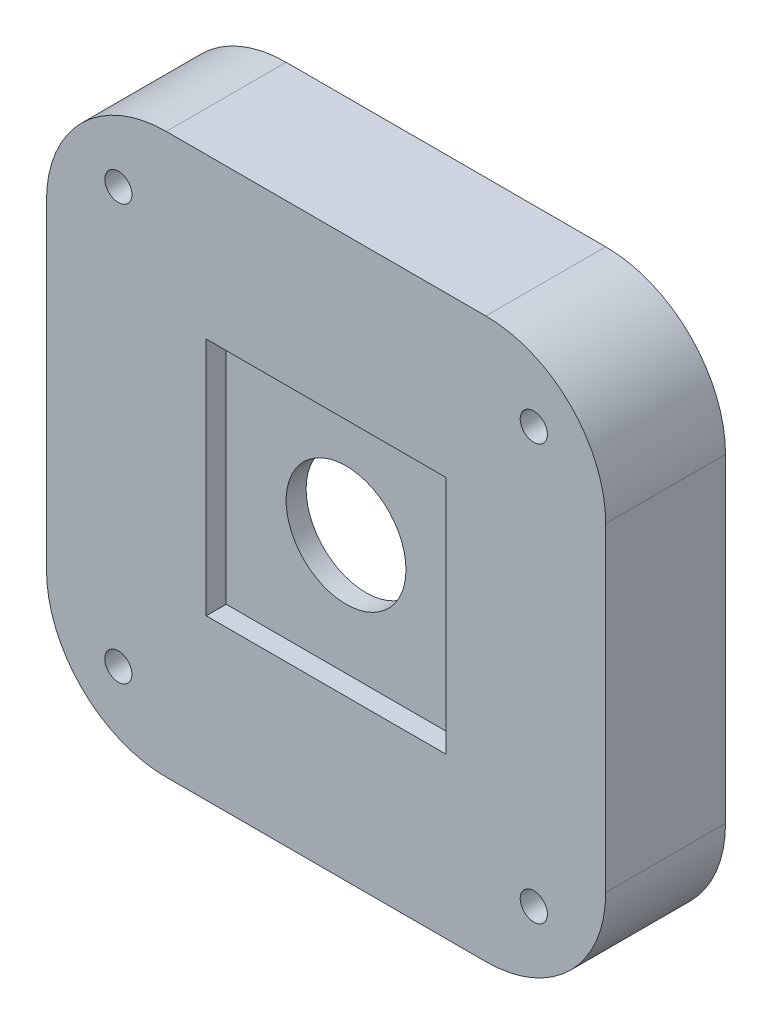
ISO-10303-21;
HEADER;
FILE_DESCRIPTION(('STEP AP214'),'2;1');
FILE_NAME('part.step','',(''),(''),'','','');
FILE_SCHEMA(('AUTOMOTIVE_DESIGN { 1 0 10303 214 1 1 1 1 }'));
ENDSEC;
DATA;
#1=APPLICATION_CONTEXT('core data for automotive mechanical design processes');
#2=APPLICATION_PROTOCOL_DEFINITION('international standard','automotive_design',2000,#1);
#3=PRODUCT_CONTEXT('',#1,'mechanical');
#4=PRODUCT('Part','Part','',(#3));
#5=PRODUCT_RELATED_PRODUCT_CATEGORY('part','',(#4));
#6=PRODUCT_DEFINITION_FORMATION('','',#4);
#7=PRODUCT_DEFINITION_CONTEXT('part definition',#1,'design');
#8=PRODUCT_DEFINITION('design','',#6,#7);
#9=PRODUCT_DEFINITION_SHAPE('','',#8);
#10=(LENGTH_UNIT() NAMED_UNIT(*) SI_UNIT(.MILLI.,.METRE.));
#11=(NAMED_UNIT(*) PLANE_ANGLE_UNIT() SI_UNIT($,.RADIAN.));
#12=(NAMED_UNIT(*) SI_UNIT($,.STERADIAN.) SOLID_ANGLE_UNIT());
#13=UNCERTAINTY_MEASURE_WITH_UNIT(LENGTH_MEASURE(1.E-05),#10,'distance_accuracy_value','');
#14=(GEOMETRIC_REPRESENTATION_CONTEXT(3) GLOBAL_UNCERTAINTY_ASSIGNED_CONTEXT((#13)) GLOBAL_UNIT_ASSIGNED_CONTEXT((#10,
#11,#12)) REPRESENTATION_CONTEXT('',''));
#15=CARTESIAN_POINT('',(0.,0.,0.));
#16=DIRECTION('',(0.,0.,1.));
#17=DIRECTION('',(1.,0.,0.));
#18=AXIS2_PLACEMENT_3D('',#15,#16,#17);
#19=CARTESIAN_POINT('',(0.,0.,0.));
#20=DIRECTION('',(0.,0.,1.));
#21=DIRECTION('',(1.,0.,0.));
#22=AXIS2_PLACEMENT_3D('',#19,#20,#21);
#23=CYLINDRICAL_SURFACE('',#22,7.5);
#24=CARTESIAN_POINT('',(0.,0.,12.5));
#25=DIRECTION('',(0.,0.,1.));
#26=DIRECTION('',(1.,0.,0.));
#27=AXIS2_PLACEMENT_3D('',#24,#25,#26);
#28=CIRCLE('',#27,7.5);
#29=CARTESIAN_POINT('',(7.5,0.,12.5));
#30=VERTEX_POINT('',#29);
#31=EDGE_CURVE('E243',#30,#30,#28,.F.);
#32=ORIENTED_EDGE('',*,*,#31,.F.);
#33=EDGE_LOOP('',(#32));
#34=FACE_BOUND('',#33,.T.);
#35=CARTESIAN_POINT('',(0.,0.,10.));
#36=DIRECTION('',(0.,0.,-1.));
#37=DIRECTION('',(-1.,0.,0.));
#38=AXIS2_PLACEMENT_3D('',#35,#36,#37);
#39=CIRCLE('',#38,7.5);
#40=CARTESIAN_POINT('',(-7.5,0.,10.));
#41=VERTEX_POINT('',#40);
#42=EDGE_CURVE('E47',#41,#41,#39,.F.);
#43=ORIENTED_EDGE('',*,*,#42,.F.);
#44=EDGE_LOOP('',(#43));
#45=FACE_BOUND('',#44,.T.);
#46=ADVANCED_FACE('F43',(#34,#45),#23,.F.);
#47=CARTESIAN_POINT('',(-35.,35.,15.));
#48=DIRECTION('',(1.,0.,0.));
#49=DIRECTION('',(0.,0.,-1.));
#50=AXIS2_PLACEMENT_3D('',#47,#48,#49);
#51=PLANE('',#50);
#52=DIRECTION('',(0.,-1.,0.));
#53=VECTOR('',#52,1.);
#54=CARTESIAN_POINT('',(-35.,35.,0.));
#55=LINE('',#54,#53);
#56=CARTESIAN_POINT('',(-35.,20.,0.));
#57=VERTEX_POINT('',#56);
#58=CARTESIAN_POINT('',(-35.,-20.,0.));
#59=VERTEX_POINT('',#58);
#60=EDGE_CURVE('E284',#57,#59,#55,.T.);
#61=ORIENTED_EDGE('',*,*,#60,.T.);
#62=DIRECTION('',(0.,0.,-1.));
#63=VECTOR('',#62,1.);
#64=CARTESIAN_POINT('',(-35.,-20.,15.));
#65=LINE('',#64,#63);
#66=CARTESIAN_POINT('',(-35.,-20.,15.));
#67=VERTEX_POINT('',#66);
#68=EDGE_CURVE('E358',#59,#67,#65,.F.);
#69=ORIENTED_EDGE('',*,*,#68,.T.);
#70=DIRECTION('',(0.,-1.,0.));
#71=VECTOR('',#70,1.);
#72=CARTESIAN_POINT('',(-35.,35.,15.));
#73=LINE('',#72,#71);
#74=CARTESIAN_POINT('',(-35.,20.,15.));
#75=VERTEX_POINT('',#74);
#76=EDGE_CURVE('E285',#75,#67,#73,.T.);
#77=ORIENTED_EDGE('',*,*,#76,.F.);
#78=DIRECTION('',(0.,0.,-1.));
#79=VECTOR('',#78,1.);
#80=CARTESIAN_POINT('',(-35.,20.,15.));
#81=LINE('',#80,#79);
#82=EDGE_CURVE('E354',#75,#57,#81,.T.);
#83=ORIENTED_EDGE('',*,*,#82,.T.);
#84=EDGE_LOOP('',(#61,#69,#77,#83));
#85=FACE_BOUND('',#84,.T.);
#86=ADVANCED_FACE('F371',(#85),#51,.F.);
#87=CARTESIAN_POINT('',(35.,-35.,15.));
#88=DIRECTION('',(0.,1.,0.));
#89=DIRECTION('',(-1.,0.,0.));
#90=AXIS2_PLACEMENT_3D('',#87,#88,#89);
#91=PLANE('',#90);
#92=DIRECTION('',(1.,0.,0.));
#93=VECTOR('',#92,1.);
#94=CARTESIAN_POINT('',(35.,-35.,0.));
#95=LINE('',#94,#93);
#96=CARTESIAN_POINT('',(-20.,-35.,0.));
#97=VERTEX_POINT('',#96);
#98=CARTESIAN_POINT('',(20.,-35.,0.));
#99=VERTEX_POINT('',#98);
#100=EDGE_CURVE('E306',#97,#99,#95,.T.);
#101=ORIENTED_EDGE('',*,*,#100,.T.);
#102=DIRECTION('',(0.,0.,-1.));
#103=VECTOR('',#102,1.);
#104=CARTESIAN_POINT('',(20.,-35.,15.));
#105=LINE('',#104,#103);
#106=CARTESIAN_POINT('',(20.,-35.,15.));
#107=VERTEX_POINT('',#106);
#108=EDGE_CURVE('E339',#99,#107,#105,.F.);
#109=ORIENTED_EDGE('',*,*,#108,.T.);
#110=DIRECTION('',(1.,0.,0.));
#111=VECTOR('',#110,1.);
#112=CARTESIAN_POINT('',(35.,-35.,15.));
#113=LINE('',#112,#111);
#114=CARTESIAN_POINT('',(-20.,-35.,15.));
#115=VERTEX_POINT('',#114);
#116=EDGE_CURVE('E289',#115,#107,#113,.T.);
#117=ORIENTED_EDGE('',*,*,#116,.F.);
#118=DIRECTION('',(0.,0.,-1.));
#119=VECTOR('',#118,1.);
#120=CARTESIAN_POINT('',(-20.,-35.,15.));
#121=LINE('',#120,#119);
#122=EDGE_CURVE('E335',#115,#97,#121,.T.);
#123=ORIENTED_EDGE('',*,*,#122,.T.);
#124=EDGE_LOOP('',(#101,#109,#117,#123));
#125=FACE_BOUND('',#124,.T.);
#126=ADVANCED_FACE('F443',(#125),#91,.F.);
#127=CARTESIAN_POINT('',(35.,35.,15.));
#128=DIRECTION('',(-1.,0.,0.));
#129=DIRECTION('',(0.,0.,1.));
#130=AXIS2_PLACEMENT_3D('',#127,#128,#129);
#131=PLANE('',#130);
#132=DIRECTION('',(0.,1.,0.));
#133=VECTOR('',#132,1.);
#134=CARTESIAN_POINT('',(35.,35.,15.));
#135=LINE('',#134,#133);
#136=CARTESIAN_POINT('',(35.,-20.,15.));
#137=VERTEX_POINT('',#136);
#138=CARTESIAN_POINT('',(35.,20.,15.));
#139=VERTEX_POINT('',#138);
#140=EDGE_CURVE('E294',#137,#139,#135,.T.);
#141=ORIENTED_EDGE('',*,*,#140,.F.);
#142=DIRECTION('',(0.,0.,-1.));
#143=VECTOR('',#142,1.);
#144=CARTESIAN_POINT('',(35.,-20.,15.));
#145=LINE('',#144,#143);
#146=CARTESIAN_POINT('',(35.,-20.,0.));
#147=VERTEX_POINT('',#146);
#148=EDGE_CURVE('E319',#137,#147,#145,.T.);
#149=ORIENTED_EDGE('',*,*,#148,.T.);
#150=DIRECTION('',(0.,1.,0.));
#151=VECTOR('',#150,1.);
#152=CARTESIAN_POINT('',(35.,35.,0.));
#153=LINE('',#152,#151);
#154=CARTESIAN_POINT('',(35.,20.,0.));
#155=VERTEX_POINT('',#154);
#156=EDGE_CURVE('E310',#147,#155,#153,.T.);
#157=ORIENTED_EDGE('',*,*,#156,.T.);
#158=DIRECTION('',(0.,0.,-1.));
#159=VECTOR('',#158,1.);
#160=CARTESIAN_POINT('',(35.,20.,15.));
#161=LINE('',#160,#159);
#162=EDGE_CURVE('E302',#155,#139,#161,.F.);
#163=ORIENTED_EDGE('',*,*,#162,.T.);
#164=EDGE_LOOP('',(#141,#149,#157,#163));
#165=FACE_BOUND('',#164,.T.);
#166=ADVANCED_FACE('F439',(#165),#131,.F.);
#167=CARTESIAN_POINT('',(35.,35.,15.));
#168=DIRECTION('',(0.,-1.,0.));
#169=DIRECTION('',(0.,0.,-1.));
#170=AXIS2_PLACEMENT_3D('',#167,#168,#169);
#171=PLANE('',#170);
#172=DIRECTION('',(-1.,0.,0.));
#173=VECTOR('',#172,1.);
#174=CARTESIAN_POINT('',(35.,35.,0.));
#175=LINE('',#174,#173);
#176=CARTESIAN_POINT('',(20.,35.,0.));
#177=VERTEX_POINT('',#176);
#178=CARTESIAN_POINT('',(-20.,35.,0.));
#179=VERTEX_POINT('',#178);
#180=EDGE_CURVE('E290',#177,#179,#175,.T.);
#181=ORIENTED_EDGE('',*,*,#180,.T.);
#182=DIRECTION('',(0.,0.,-1.));
#183=VECTOR('',#182,1.);
#184=CARTESIAN_POINT('',(-20.,35.,15.));
#185=LINE('',#184,#183);
#186=CARTESIAN_POINT('',(-20.,35.,15.));
#187=VERTEX_POINT('',#186);
#188=EDGE_CURVE('E11',#179,#187,#185,.F.);
#189=ORIENTED_EDGE('',*,*,#188,.T.);
#190=DIRECTION('',(-1.,0.,0.));
#191=VECTOR('',#190,1.);
#192=CARTESIAN_POINT('',(35.,35.,15.));
#193=LINE('',#192,#191);
#194=CARTESIAN_POINT('',(20.,35.,15.));
#195=VERTEX_POINT('',#194);
#196=EDGE_CURVE('E298',#195,#187,#193,.T.);
#197=ORIENTED_EDGE('',*,*,#196,.F.);
#198=DIRECTION('',(0.,0.,-1.));
#199=VECTOR('',#198,1.);
#200=CARTESIAN_POINT('',(20.,35.,15.));
#201=LINE('',#200,#199);
#202=EDGE_CURVE('E53',#195,#177,#201,.T.);
#203=ORIENTED_EDGE('',*,*,#202,.T.);
#204=EDGE_LOOP('',(#181,#189,#197,#203));
#205=FACE_BOUND('',#204,.T.);
#206=ADVANCED_FACE('F432',(#205),#171,.F.);
#207=CARTESIAN_POINT('',(0.,0.,15.));
#208=DIRECTION('',(0.,0.,-1.));
#209=DIRECTION('',(-1.,0.,0.));
#210=AXIS2_PLACEMENT_3D('',#207,#208,#209);
#211=PLANE('',#210);
#212=DIRECTION('',(1.,0.,0.));
#213=VECTOR('',#212,1.);
#214=CARTESIAN_POINT('',(15.,-15.,15.));
#215=LINE('',#214,#213);
#216=CARTESIAN_POINT('',(-15.,-15.,15.));
#217=VERTEX_POINT('',#216);
#218=CARTESIAN_POINT('',(15.,-15.,15.));
#219=VERTEX_POINT('',#218);
#220=EDGE_CURVE('E229',#217,#219,#215,.T.);
#221=ORIENTED_EDGE('',*,*,#220,.F.);
#222=DIRECTION('',(0.,-1.,0.));
#223=VECTOR('',#222,1.);
#224=CARTESIAN_POINT('',(-15.,-15.,15.));
#225=LINE('',#224,#223);
#226=CARTESIAN_POINT('',(-15.,15.,15.));
#227=VERTEX_POINT('',#226);
#228=EDGE_CURVE('E69',#227,#217,#225,.T.);
#229=ORIENTED_EDGE('',*,*,#228,.F.);
#230=DIRECTION('',(-1.,0.,0.));
#231=VECTOR('',#230,1.);
#232=CARTESIAN_POINT('',(15.,15.,15.));
#233=LINE('',#232,#231);
#234=CARTESIAN_POINT('',(15.,15.,15.));
#235=VERTEX_POINT('',#234);
#236=EDGE_CURVE('E214',#235,#227,#233,.T.);
#237=ORIENTED_EDGE('',*,*,#236,.F.);
#238=DIRECTION('',(0.,1.,0.));
#239=VECTOR('',#238,1.);
#240=CARTESIAN_POINT('',(15.,-15.,15.));
#241=LINE('',#240,#239);
#242=EDGE_CURVE('E233',#219,#235,#241,.T.);
#243=ORIENTED_EDGE('',*,*,#242,.F.);
#244=EDGE_LOOP('',(#221,#229,#237,#243));
#245=FACE_BOUND('',#244,.T.);
#246=CARTESIAN_POINT('',(-26.,-26.0000000000001,15.));
#247=DIRECTION('',(0.,0.,1.));
#248=DIRECTION('',(1.,0.,0.));
#249=AXIS2_PLACEMENT_3D('',#246,#247,#248);
#250=CIRCLE('',#249,1.7);
#251=CARTESIAN_POINT('',(-24.3,-26.0000000000001,15.));
#252=VERTEX_POINT('',#251);
#253=EDGE_CURVE('E252',#252,#252,#250,.T.);
#254=ORIENTED_EDGE('',*,*,#253,.F.);
#255=EDGE_LOOP('',(#254));
#256=FACE_BOUND('',#255,.T.);
#257=CARTESIAN_POINT('',(26.,-26.,15.));
#258=DIRECTION('',(0.,0.,1.));
#259=DIRECTION('',(1.,0.,0.));
#260=AXIS2_PLACEMENT_3D('',#257,#258,#259);
#261=CIRCLE('',#260,1.7);
#262=CARTESIAN_POINT('',(27.7,-26.,15.));
#263=VERTEX_POINT('',#262);
#264=EDGE_CURVE('E260',#263,#263,#261,.T.);
#265=ORIENTED_EDGE('',*,*,#264,.F.);
#266=EDGE_LOOP('',(#265));
#267=FACE_BOUND('',#266,.T.);
#268=CARTESIAN_POINT('',(26.,26.,15.));
#269=DIRECTION('',(0.,0.,1.));
#270=DIRECTION('',(1.,0.,0.));
#271=AXIS2_PLACEMENT_3D('',#268,#269,#270);
#272=CIRCLE('',#271,1.7);
#273=CARTESIAN_POINT('',(27.7,26.,15.));
#274=VERTEX_POINT('',#273);
#275=EDGE_CURVE('E268',#274,#274,#272,.T.);
#276=ORIENTED_EDGE('',*,*,#275,.F.);
#277=EDGE_LOOP('',(#276));
#278=FACE_BOUND('',#277,.T.);
#279=CARTESIAN_POINT('',(-26.0000000000001,26.,15.));
#280=DIRECTION('',(0.,0.,1.));
#281=DIRECTION('',(1.,0.,0.));
#282=AXIS2_PLACEMENT_3D('',#279,#280,#281);
#283=CIRCLE('',#282,1.7);
#284=CARTESIAN_POINT('',(-24.3000000000001,26.,15.));
#285=VERTEX_POINT('',#284);
#286=EDGE_CURVE('E276',#285,#285,#283,.T.);
#287=ORIENTED_EDGE('',*,*,#286,.F.);
#288=EDGE_LOOP('',(#287));
#289=FACE_BOUND('',#288,.T.);
#290=ORIENTED_EDGE('',*,*,#116,.T.);
#291=CARTESIAN_POINT('',(20.,-20.,15.));
#292=DIRECTION('',(0.,0.,-1.));
#293=DIRECTION('',(-1.,0.,0.));
#294=AXIS2_PLACEMENT_3D('',#291,#292,#293);
#295=CIRCLE('',#294,15.);
#296=EDGE_CURVE('E351',#107,#137,#295,.F.);
#297=ORIENTED_EDGE('',*,*,#296,.T.);
#298=ORIENTED_EDGE('',*,*,#140,.T.);
#299=CARTESIAN_POINT('',(20.,20.,15.));
#300=DIRECTION('',(0.,0.,-1.));
#301=DIRECTION('',(-1.,0.,0.));
#302=AXIS2_PLACEMENT_3D('',#299,#300,#301);
#303=CIRCLE('',#302,15.);
#304=EDGE_CURVE('E342',#139,#195,#303,.F.);
#305=ORIENTED_EDGE('',*,*,#304,.T.);
#306=ORIENTED_EDGE('',*,*,#196,.T.);
#307=CARTESIAN_POINT('',(-20.,20.,15.));
#308=DIRECTION('',(0.,0.,-1.));
#309=DIRECTION('',(-1.,0.,0.));
#310=AXIS2_PLACEMENT_3D('',#307,#308,#309);
#311=CIRCLE('',#310,15.);
#312=EDGE_CURVE('E345',#187,#75,#311,.F.);
#313=ORIENTED_EDGE('',*,*,#312,.T.);
#314=ORIENTED_EDGE('',*,*,#76,.T.);
#315=CARTESIAN_POINT('',(-20.,-20.,15.));
#316=DIRECTION('',(0.,0.,-1.));
#317=DIRECTION('',(-1.,0.,0.));
#318=AXIS2_PLACEMENT_3D('',#315,#316,#317);
#319=CIRCLE('',#318,15.);
#320=EDGE_CURVE('E348',#67,#115,#319,.F.);
#321=ORIENTED_EDGE('',*,*,#320,.T.);
#322=EDGE_LOOP('',(#290,#297,#298,#305,#306,#313,#314,#321));
#323=FACE_BOUND('',#322,.T.);
#324=ADVANCED_FACE('F428',(#245,#256,#267,#278,#289,#323),#211,.F.);
#325=CARTESIAN_POINT('',(0.,0.,0.));
#326=DIRECTION('',(0.,0.,-1.));
#327=DIRECTION('',(-1.,0.,0.));
#328=AXIS2_PLACEMENT_3D('',#325,#326,#327);
#329=PLANE('',#328);
#330=DIRECTION('',(0.,1.,0.));
#331=VECTOR('',#330,1.);
#332=CARTESIAN_POINT('',(-22.5,22.5,0.));
#333=LINE('',#332,#331);
#334=CARTESIAN_POINT('',(-22.5,-22.5,0.));
#335=VERTEX_POINT('',#334);
#336=CARTESIAN_POINT('',(-22.5,22.5,0.));
#337=VERTEX_POINT('',#336);
#338=EDGE_CURVE('E61',#335,#337,#333,.T.);
#339=ORIENTED_EDGE('',*,*,#338,.F.);
#340=DIRECTION('',(-1.,0.,0.));
#341=VECTOR('',#340,1.);
#342=CARTESIAN_POINT('',(22.5,-22.5,0.));
#343=LINE('',#342,#341);
#344=CARTESIAN_POINT('',(22.5,-22.5,0.));
#345=VERTEX_POINT('',#344);
#346=EDGE_CURVE('E182',#345,#335,#343,.T.);
#347=ORIENTED_EDGE('',*,*,#346,.F.);
#348=DIRECTION('',(0.,-1.,0.));
#349=VECTOR('',#348,1.);
#350=CARTESIAN_POINT('',(22.5,22.5,0.));
#351=LINE('',#350,#349);
#352=CARTESIAN_POINT('',(22.5,22.5,0.));
#353=VERTEX_POINT('',#352);
#354=EDGE_CURVE('E186',#353,#345,#351,.T.);
#355=ORIENTED_EDGE('',*,*,#354,.F.);
#356=DIRECTION('',(1.,0.,0.));
#357=VECTOR('',#356,1.);
#358=CARTESIAN_POINT('',(22.5,22.5,0.));
#359=LINE('',#358,#357);
#360=EDGE_CURVE('E195',#337,#353,#359,.T.);
#361=ORIENTED_EDGE('',*,*,#360,.F.);
#362=EDGE_LOOP('',(#339,#347,#355,#361));
#363=FACE_BOUND('',#362,.T.);
#364=CARTESIAN_POINT('',(-26.,-26.0000000000001,0.));
#365=DIRECTION('',(0.,0.,1.));
#366=DIRECTION('',(1.,0.,0.));
#367=AXIS2_PLACEMENT_3D('',#364,#365,#366);
#368=CIRCLE('',#367,1.7);
#369=CARTESIAN_POINT('',(-24.3,-26.0000000000001,0.));
#370=VERTEX_POINT('',#369);
#371=EDGE_CURVE('E256',#370,#370,#368,.T.);
#372=ORIENTED_EDGE('',*,*,#371,.T.);
#373=EDGE_LOOP('',(#372));
#374=FACE_BOUND('',#373,.T.);
#375=CARTESIAN_POINT('',(26.,-26.,0.));
#376=DIRECTION('',(0.,0.,1.));
#377=DIRECTION('',(1.,0.,0.));
#378=AXIS2_PLACEMENT_3D('',#375,#376,#377);
#379=CIRCLE('',#378,1.7);
#380=CARTESIAN_POINT('',(27.7,-26.,0.));
#381=VERTEX_POINT('',#380);
#382=EDGE_CURVE('E264',#381,#381,#379,.T.);
#383=ORIENTED_EDGE('',*,*,#382,.T.);
#384=EDGE_LOOP('',(#383));
#385=FACE_BOUND('',#384,.T.);
#386=CARTESIAN_POINT('',(26.,26.,0.));
#387=DIRECTION('',(0.,0.,1.));
#388=DIRECTION('',(1.,0.,0.));
#389=AXIS2_PLACEMENT_3D('',#386,#387,#388);
#390=CIRCLE('',#389,1.7);
#391=CARTESIAN_POINT('',(27.7,26.,0.));
#392=VERTEX_POINT('',#391);
#393=EDGE_CURVE('E272',#392,#392,#390,.T.);
#394=ORIENTED_EDGE('',*,*,#393,.T.);
#395=EDGE_LOOP('',(#394));
#396=FACE_BOUND('',#395,.T.);
#397=CARTESIAN_POINT('',(-26.0000000000001,26.,0.));
#398=DIRECTION('',(0.,0.,1.));
#399=DIRECTION('',(1.,0.,0.));
#400=AXIS2_PLACEMENT_3D('',#397,#398,#399);
#401=CIRCLE('',#400,1.7);
#402=CARTESIAN_POINT('',(-24.3000000000001,26.,0.));
#403=VERTEX_POINT('',#402);
#404=EDGE_CURVE('E280',#403,#403,#401,.T.);
#405=ORIENTED_EDGE('',*,*,#404,.T.);
#406=EDGE_LOOP('',(#405));
#407=FACE_BOUND('',#406,.T.);
#408=ORIENTED_EDGE('',*,*,#156,.F.);
#409=CARTESIAN_POINT('',(20.,-20.,0.));
#410=DIRECTION('',(0.,0.,-1.));
#411=DIRECTION('',(-1.,0.,0.));
#412=AXIS2_PLACEMENT_3D('',#409,#410,#411);
#413=CIRCLE('',#412,15.);
#414=EDGE_CURVE('E332',#147,#99,#413,.T.);
#415=ORIENTED_EDGE('',*,*,#414,.T.);
#416=ORIENTED_EDGE('',*,*,#100,.F.);
#417=CARTESIAN_POINT('',(-20.,-20.,0.));
#418=DIRECTION('',(0.,0.,-1.));
#419=DIRECTION('',(-1.,0.,0.));
#420=AXIS2_PLACEMENT_3D('',#417,#418,#419);
#421=CIRCLE('',#420,15.);
#422=EDGE_CURVE('E329',#97,#59,#421,.T.);
#423=ORIENTED_EDGE('',*,*,#422,.T.);
#424=ORIENTED_EDGE('',*,*,#60,.F.);
#425=CARTESIAN_POINT('',(-20.,20.,0.));
#426=DIRECTION('',(0.,0.,-1.));
#427=DIRECTION('',(-1.,0.,0.));
#428=AXIS2_PLACEMENT_3D('',#425,#426,#427);
#429=CIRCLE('',#428,15.);
#430=EDGE_CURVE('E326',#57,#179,#429,.T.);
#431=ORIENTED_EDGE('',*,*,#430,.T.);
#432=ORIENTED_EDGE('',*,*,#180,.F.);
#433=CARTESIAN_POINT('',(20.,20.,0.));
#434=DIRECTION('',(0.,0.,-1.));
#435=DIRECTION('',(-1.,0.,0.));
#436=AXIS2_PLACEMENT_3D('',#433,#434,#435);
#437=CIRCLE('',#436,15.);
#438=EDGE_CURVE('E323',#177,#155,#437,.T.);
#439=ORIENTED_EDGE('',*,*,#438,.T.);
#440=EDGE_LOOP('',(#408,#415,#416,#423,#424,#431,#432,#439));
#441=FACE_BOUND('',#440,.T.);
#442=ADVANCED_FACE('F431',(#363,#374,#385,#396,#407,#441),#329,.T.);
#443=CARTESIAN_POINT('',(20.,-20.,15.));
#444=DIRECTION('',(0.,0.,-1.));
#445=DIRECTION('',(-1.,0.,0.));
#446=AXIS2_PLACEMENT_3D('',#443,#444,#445);
#447=CYLINDRICAL_SURFACE('',#446,15.);
#448=ORIENTED_EDGE('',*,*,#296,.F.);
#449=ORIENTED_EDGE('',*,*,#108,.F.);
#450=ORIENTED_EDGE('',*,*,#414,.F.);
#451=ORIENTED_EDGE('',*,*,#148,.F.);
#452=EDGE_LOOP('',(#448,#449,#450,#451));
#453=FACE_BOUND('',#452,.T.);
#454=ADVANCED_FACE('F435',(#453),#447,.T.);
#455=CARTESIAN_POINT('',(-20.,-20.,15.));
#456=DIRECTION('',(0.,0.,-1.));
#457=DIRECTION('',(-1.,0.,0.));
#458=AXIS2_PLACEMENT_3D('',#455,#456,#457);
#459=CYLINDRICAL_SURFACE('',#458,15.);
#460=ORIENTED_EDGE('',*,*,#320,.F.);
#461=ORIENTED_EDGE('',*,*,#68,.F.);
#462=ORIENTED_EDGE('',*,*,#422,.F.);
#463=ORIENTED_EDGE('',*,*,#122,.F.);
#464=EDGE_LOOP('',(#460,#461,#462,#463));
#465=FACE_BOUND('',#464,.T.);
#466=ADVANCED_FACE('F453',(#465),#459,.T.);
#467=CARTESIAN_POINT('',(-20.,20.,15.));
#468=DIRECTION('',(0.,0.,-1.));
#469=DIRECTION('',(-1.,0.,0.));
#470=AXIS2_PLACEMENT_3D('',#467,#468,#469);
#471=CYLINDRICAL_SURFACE('',#470,15.);
#472=ORIENTED_EDGE('',*,*,#312,.F.);
#473=ORIENTED_EDGE('',*,*,#188,.F.);
#474=ORIENTED_EDGE('',*,*,#430,.F.);
#475=ORIENTED_EDGE('',*,*,#82,.F.);
#476=EDGE_LOOP('',(#472,#473,#474,#475));
#477=FACE_BOUND('',#476,.T.);
#478=ADVANCED_FACE('F456',(#477),#471,.T.);
#479=CARTESIAN_POINT('',(20.,20.,15.));
#480=DIRECTION('',(0.,0.,-1.));
#481=DIRECTION('',(-1.,0.,0.));
#482=AXIS2_PLACEMENT_3D('',#479,#480,#481);
#483=CYLINDRICAL_SURFACE('',#482,15.);
#484=ORIENTED_EDGE('',*,*,#304,.F.);
#485=ORIENTED_EDGE('',*,*,#162,.F.);
#486=ORIENTED_EDGE('',*,*,#438,.F.);
#487=ORIENTED_EDGE('',*,*,#202,.F.);
#488=EDGE_LOOP('',(#484,#485,#486,#487));
#489=FACE_BOUND('',#488,.T.);
#490=ADVANCED_FACE('F45',(#489),#483,.T.);
#491=CARTESIAN_POINT('',(-26.0000000000001,26.,15.));
#492=DIRECTION('',(0.,0.,1.));
#493=DIRECTION('',(1.,0.,0.));
#494=AXIS2_PLACEMENT_3D('',#491,#492,#493);
#495=CYLINDRICAL_SURFACE('',#494,1.7);
#496=ORIENTED_EDGE('',*,*,#404,.F.);
#497=EDGE_LOOP('',(#496));
#498=FACE_BOUND('',#497,.T.);
#499=ORIENTED_EDGE('',*,*,#286,.T.);
#500=EDGE_LOOP('',(#499));
#501=FACE_BOUND('',#500,.T.);
#502=ADVANCED_FACE('F423',(#498,#501),#495,.F.);
#503=CARTESIAN_POINT('',(26.,26.,15.));
#504=DIRECTION('',(0.,0.,1.));
#505=DIRECTION('',(1.,0.,0.));
#506=AXIS2_PLACEMENT_3D('',#503,#504,#505);
#507=CYLINDRICAL_SURFACE('',#506,1.7);
#508=ORIENTED_EDGE('',*,*,#393,.F.);
#509=EDGE_LOOP('',(#508));
#510=FACE_BOUND('',#509,.T.);
#511=ORIENTED_EDGE('',*,*,#275,.T.);
#512=EDGE_LOOP('',(#511));
#513=FACE_BOUND('',#512,.T.);
#514=ADVANCED_FACE('F419',(#510,#513),#507,.F.);
#515=CARTESIAN_POINT('',(26.,-26.,15.));
#516=DIRECTION('',(0.,0.,1.));
#517=DIRECTION('',(1.,0.,0.));
#518=AXIS2_PLACEMENT_3D('',#515,#516,#517);
#519=CYLINDRICAL_SURFACE('',#518,1.7);
#520=ORIENTED_EDGE('',*,*,#382,.F.);
#521=EDGE_LOOP('',(#520));
#522=FACE_BOUND('',#521,.T.);
#523=ORIENTED_EDGE('',*,*,#264,.T.);
#524=EDGE_LOOP('',(#523));
#525=FACE_BOUND('',#524,.T.);
#526=ADVANCED_FACE('F415',(#522,#525),#519,.F.);
#527=CARTESIAN_POINT('',(-26.,-26.0000000000001,15.));
#528=DIRECTION('',(0.,0.,1.));
#529=DIRECTION('',(1.,0.,0.));
#530=AXIS2_PLACEMENT_3D('',#527,#528,#529);
#531=CYLINDRICAL_SURFACE('',#530,1.7);
#532=ORIENTED_EDGE('',*,*,#371,.F.);
#533=EDGE_LOOP('',(#532));
#534=FACE_BOUND('',#533,.T.);
#535=ORIENTED_EDGE('',*,*,#253,.T.);
#536=EDGE_LOOP('',(#535));
#537=FACE_BOUND('',#536,.T.);
#538=ADVANCED_FACE('F402',(#534,#537),#531,.F.);
#539=CARTESIAN_POINT('',(0.,0.,12.5));
#540=DIRECTION('',(0.,0.,1.));
#541=DIRECTION('',(1.,0.,0.));
#542=AXIS2_PLACEMENT_3D('',#539,#540,#541);
#543=PLANE('',#542);
#544=DIRECTION('',(0.,-1.,0.));
#545=VECTOR('',#544,1.);
#546=CARTESIAN_POINT('',(-15.,-15.,12.5));
#547=LINE('',#546,#545);
#548=CARTESIAN_POINT('',(-15.,15.,12.5));
#549=VERTEX_POINT('',#548);
#550=CARTESIAN_POINT('',(-15.,-15.,12.5));
#551=VERTEX_POINT('',#550);
#552=EDGE_CURVE('E209',#549,#551,#547,.T.);
#553=ORIENTED_EDGE('',*,*,#552,.T.);
#554=DIRECTION('',(1.,0.,0.));
#555=VECTOR('',#554,1.);
#556=CARTESIAN_POINT('',(15.,-15.,12.5));
#557=LINE('',#556,#555);
#558=CARTESIAN_POINT('',(15.,-15.,12.5));
#559=VERTEX_POINT('',#558);
#560=EDGE_CURVE('E213',#551,#559,#557,.T.);
#561=ORIENTED_EDGE('',*,*,#560,.T.);
#562=DIRECTION('',(0.,1.,0.));
#563=VECTOR('',#562,1.);
#564=CARTESIAN_POINT('',(15.,-15.,12.5));
#565=LINE('',#564,#563);
#566=CARTESIAN_POINT('',(15.,15.,12.5));
#567=VERTEX_POINT('',#566);
#568=EDGE_CURVE('E218',#559,#567,#565,.T.);
#569=ORIENTED_EDGE('',*,*,#568,.T.);
#570=DIRECTION('',(-1.,0.,0.));
#571=VECTOR('',#570,1.);
#572=CARTESIAN_POINT('',(15.,15.,12.5));
#573=LINE('',#572,#571);
#574=EDGE_CURVE('E222',#567,#549,#573,.T.);
#575=ORIENTED_EDGE('',*,*,#574,.T.);
#576=EDGE_LOOP('',(#553,#561,#569,#575));
#577=FACE_BOUND('',#576,.T.);
#578=ORIENTED_EDGE('',*,*,#31,.T.);
#579=EDGE_LOOP('',(#578));
#580=FACE_BOUND('',#579,.T.);
#581=ADVANCED_FACE('F367',(#577,#580),#543,.T.);
#582=CARTESIAN_POINT('',(-15.,-15.,12.5));
#583=DIRECTION('',(-1.,0.,0.));
#584=DIRECTION('',(0.,0.,1.));
#585=AXIS2_PLACEMENT_3D('',#582,#583,#584);
#586=PLANE('',#585);
#587=ORIENTED_EDGE('',*,*,#228,.T.);
#588=DIRECTION('',(0.,0.,1.));
#589=VECTOR('',#588,1.);
#590=CARTESIAN_POINT('',(-15.,-15.,12.5));
#591=LINE('',#590,#589);
#592=EDGE_CURVE('E226',#551,#217,#591,.T.);
#593=ORIENTED_EDGE('',*,*,#592,.F.);
#594=ORIENTED_EDGE('',*,*,#552,.F.);
#595=DIRECTION('',(0.,0.,1.));
#596=VECTOR('',#595,1.);
#597=CARTESIAN_POINT('',(-15.,15.,12.5));
#598=LINE('',#597,#596);
#599=EDGE_CURVE('E240',#549,#227,#598,.T.);
#600=ORIENTED_EDGE('',*,*,#599,.T.);
#601=EDGE_LOOP('',(#587,#593,#594,#600));
#602=FACE_BOUND('',#601,.T.);
#603=ADVANCED_FACE('F401',(#602),#586,.F.);
#604=CARTESIAN_POINT('',(15.,15.,12.5));
#605=DIRECTION('',(0.,1.,0.));
#606=DIRECTION('',(-1.,0.,0.));
#607=AXIS2_PLACEMENT_3D('',#604,#605,#606);
#608=PLANE('',#607);
#609=ORIENTED_EDGE('',*,*,#236,.T.);
#610=ORIENTED_EDGE('',*,*,#599,.F.);
#611=ORIENTED_EDGE('',*,*,#574,.F.);
#612=DIRECTION('',(0.,0.,1.));
#613=VECTOR('',#612,1.);
#614=CARTESIAN_POINT('',(15.,15.,12.5));
#615=LINE('',#614,#613);
#616=EDGE_CURVE('E244',#567,#235,#615,.T.);
#617=ORIENTED_EDGE('',*,*,#616,.T.);
#618=EDGE_LOOP('',(#609,#610,#611,#617));
#619=FACE_BOUND('',#618,.T.);
#620=ADVANCED_FACE('F404',(#619),#608,.F.);
#621=CARTESIAN_POINT('',(15.,-15.,12.5));
#622=DIRECTION('',(1.,0.,0.));
#623=DIRECTION('',(0.,0.,-1.));
#624=AXIS2_PLACEMENT_3D('',#621,#622,#623);
#625=PLANE('',#624);
#626=ORIENTED_EDGE('',*,*,#242,.T.);
#627=ORIENTED_EDGE('',*,*,#616,.F.);
#628=ORIENTED_EDGE('',*,*,#568,.F.);
#629=DIRECTION('',(0.,0.,1.));
#630=VECTOR('',#629,1.);
#631=CARTESIAN_POINT('',(15.,-15.,12.5));
#632=LINE('',#631,#630);
#633=EDGE_CURVE('E247',#559,#219,#632,.T.);
#634=ORIENTED_EDGE('',*,*,#633,.T.);
#635=EDGE_LOOP('',(#626,#627,#628,#634));
#636=FACE_BOUND('',#635,.T.);
#637=ADVANCED_FACE('F386',(#636),#625,.F.);
#638=CARTESIAN_POINT('',(15.,-15.,12.5));
#639=DIRECTION('',(0.,-1.,0.));
#640=DIRECTION('',(1.,0.,0.));
#641=AXIS2_PLACEMENT_3D('',#638,#639,#640);
#642=PLANE('',#641);
#643=ORIENTED_EDGE('',*,*,#220,.T.);
#644=ORIENTED_EDGE('',*,*,#633,.F.);
#645=ORIENTED_EDGE('',*,*,#560,.F.);
#646=ORIENTED_EDGE('',*,*,#592,.T.);
#647=EDGE_LOOP('',(#643,#644,#645,#646));
#648=FACE_BOUND('',#647,.T.);
#649=ADVANCED_FACE('F377',(#648),#642,.F.);
#650=CARTESIAN_POINT('',(0.,0.,10.));
#651=DIRECTION('',(0.,0.,-1.));
#652=DIRECTION('',(-1.,0.,0.));
#653=AXIS2_PLACEMENT_3D('',#650,#651,#652);
#654=PLANE('',#653);
#655=DIRECTION('',(0.,1.,0.));
#656=VECTOR('',#655,1.);
#657=CARTESIAN_POINT('',(-22.5,22.5,10.));
#658=LINE('',#657,#656);
#659=CARTESIAN_POINT('',(-22.5,-22.5,10.));
#660=VERTEX_POINT('',#659);
#661=CARTESIAN_POINT('',(-22.5,22.5,10.));
#662=VERTEX_POINT('',#661);
#663=EDGE_CURVE('E160',#660,#662,#658,.T.);
#664=ORIENTED_EDGE('',*,*,#663,.T.);
#665=DIRECTION('',(1.,0.,0.));
#666=VECTOR('',#665,1.);
#667=CARTESIAN_POINT('',(22.5,22.5,10.));
#668=LINE('',#667,#666);
#669=CARTESIAN_POINT('',(22.5,22.5,10.));
#670=VERTEX_POINT('',#669);
#671=EDGE_CURVE('E170',#662,#670,#668,.T.);
#672=ORIENTED_EDGE('',*,*,#671,.T.);
#673=DIRECTION('',(0.,-1.,0.));
#674=VECTOR('',#673,1.);
#675=CARTESIAN_POINT('',(22.5,22.5,10.));
#676=LINE('',#675,#674);
#677=CARTESIAN_POINT('',(22.5,-22.5,10.));
#678=VERTEX_POINT('',#677);
#679=EDGE_CURVE('E176',#670,#678,#676,.T.);
#680=ORIENTED_EDGE('',*,*,#679,.T.);
#681=DIRECTION('',(-1.,0.,0.));
#682=VECTOR('',#681,1.);
#683=CARTESIAN_POINT('',(22.5,-22.5,10.));
#684=LINE('',#683,#682);
#685=EDGE_CURVE('E167',#678,#660,#684,.T.);
#686=ORIENTED_EDGE('',*,*,#685,.T.);
#687=EDGE_LOOP('',(#664,#672,#680,#686));
#688=FACE_BOUND('',#687,.T.);
#689=ORIENTED_EDGE('',*,*,#42,.T.);
#690=EDGE_LOOP('',(#689));
#691=FACE_BOUND('',#690,.T.);
#692=ADVANCED_FACE('F178',(#688,#691),#654,.T.);
#693=CARTESIAN_POINT('',(-22.5,22.5,10.));
#694=DIRECTION('',(-1.,0.,0.));
#695=DIRECTION('',(0.,-1.,0.));
#696=AXIS2_PLACEMENT_3D('',#693,#694,#695);
#697=PLANE('',#696);
#698=ORIENTED_EDGE('',*,*,#338,.T.);
#699=DIRECTION('',(0.,0.,-1.));
#700=VECTOR('',#699,1.);
#701=CARTESIAN_POINT('',(-22.5,22.5,10.));
#702=LINE('',#701,#700);
#703=EDGE_CURVE('E156',#662,#337,#702,.T.);
#704=ORIENTED_EDGE('',*,*,#703,.F.);
#705=ORIENTED_EDGE('',*,*,#663,.F.);
#706=DIRECTION('',(0.,0.,-1.));
#707=VECTOR('',#706,1.);
#708=CARTESIAN_POINT('',(-22.5,-22.5,10.));
#709=LINE('',#708,#707);
#710=EDGE_CURVE('E201',#660,#335,#709,.T.);
#711=ORIENTED_EDGE('',*,*,#710,.T.);
#712=EDGE_LOOP('',(#698,#704,#705,#711));
#713=FACE_BOUND('',#712,.T.);
#714=ADVANCED_FACE('F158',(#713),#697,.F.);
#715=CARTESIAN_POINT('',(22.5,-22.5,10.));
#716=DIRECTION('',(0.,-1.,0.));
#717=DIRECTION('',(0.,0.,-1.));
#718=AXIS2_PLACEMENT_3D('',#715,#716,#717);
#719=PLANE('',#718);
#720=ORIENTED_EDGE('',*,*,#346,.T.);
#721=ORIENTED_EDGE('',*,*,#710,.F.);
#722=ORIENTED_EDGE('',*,*,#685,.F.);
#723=DIRECTION('',(0.,0.,-1.));
#724=VECTOR('',#723,1.);
#725=CARTESIAN_POINT('',(22.5,-22.5,10.));
#726=LINE('',#725,#724);
#727=EDGE_CURVE('E204',#678,#345,#726,.T.);
#728=ORIENTED_EDGE('',*,*,#727,.T.);
#729=EDGE_LOOP('',(#720,#721,#722,#728));
#730=FACE_BOUND('',#729,.T.);
#731=ADVANCED_FACE('F383',(#730),#719,.F.);
#732=CARTESIAN_POINT('',(22.5,22.5,10.));
#733=DIRECTION('',(1.,0.,0.));
#734=DIRECTION('',(0.,1.,0.));
#735=AXIS2_PLACEMENT_3D('',#732,#733,#734);
#736=PLANE('',#735);
#737=ORIENTED_EDGE('',*,*,#354,.T.);
#738=ORIENTED_EDGE('',*,*,#727,.F.);
#739=ORIENTED_EDGE('',*,*,#679,.F.);
#740=DIRECTION('',(0.,0.,-1.));
#741=VECTOR('',#740,1.);
#742=CARTESIAN_POINT('',(22.5,22.5,10.));
#743=LINE('',#742,#741);
#744=EDGE_CURVE('E166',#670,#353,#743,.T.);
#745=ORIENTED_EDGE('',*,*,#744,.T.);
#746=EDGE_LOOP('',(#737,#738,#739,#745));
#747=FACE_BOUND('',#746,.T.);
#748=ADVANCED_FACE('F392',(#747),#736,.F.);
#749=CARTESIAN_POINT('',(22.5,22.5,10.));
#750=DIRECTION('',(0.,1.,0.));
#751=DIRECTION('',(0.,0.,1.));
#752=AXIS2_PLACEMENT_3D('',#749,#750,#751);
#753=PLANE('',#752);
#754=ORIENTED_EDGE('',*,*,#360,.T.);
#755=ORIENTED_EDGE('',*,*,#744,.F.);
#756=ORIENTED_EDGE('',*,*,#671,.F.);
#757=ORIENTED_EDGE('',*,*,#703,.T.);
#758=EDGE_LOOP('',(#754,#755,#756,#757));
#759=FACE_BOUND('',#758,.T.);
#760=ADVANCED_FACE('F171',(#759),#753,.F.);
#761=CLOSED_SHELL('',(#46,#86,#126,#166,#206,#324,#442,#454,#466,#478,#490,#502,#514,#526,#538,
#581,#603,#620,#637,#649,#692,#714,#731,#748,#760));
#762=MANIFOLD_SOLID_BREP('B2',#761);
#763=ADVANCED_BREP_SHAPE_REPRESENTATION('',(#18,#762),#14);
#764=SHAPE_DEFINITION_REPRESENTATION(#9,#763);
ENDSEC;
END-ISO-10303-21;
